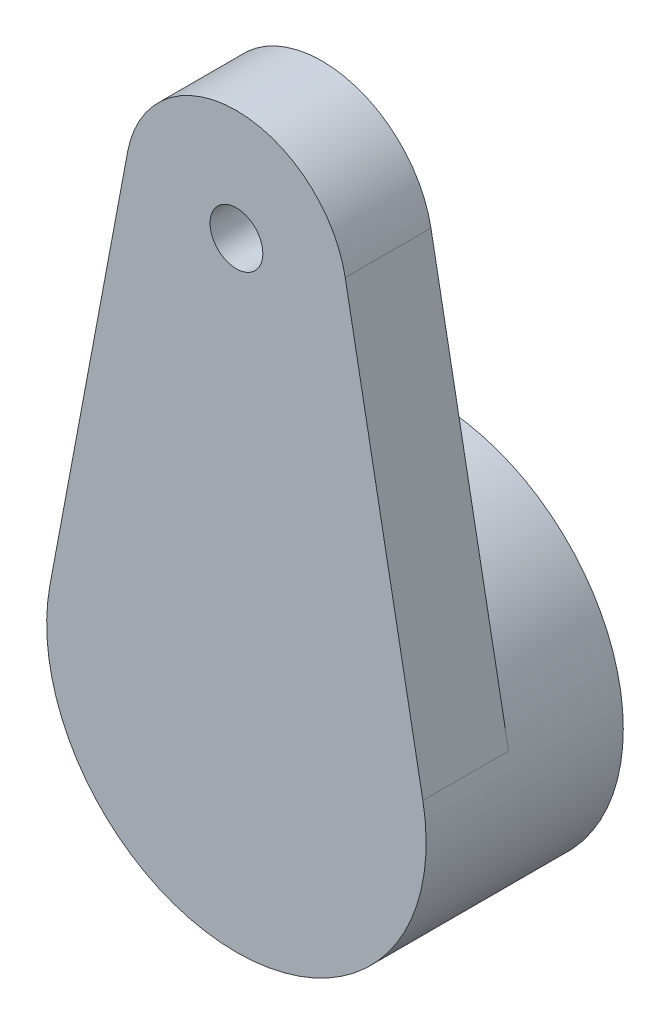
ISO-10303-21;
HEADER;
FILE_DESCRIPTION(('STEP AP214'),'2;1');
FILE_NAME('part.step','',(''),(''),'','','');
FILE_SCHEMA(('AUTOMOTIVE_DESIGN { 1 0 10303 214 1 1 1 1 }'));
ENDSEC;
DATA;
#1=APPLICATION_CONTEXT('core data for automotive mechanical design processes');
#2=APPLICATION_PROTOCOL_DEFINITION('international standard','automotive_design',2000,#1);
#3=PRODUCT_CONTEXT('',#1,'mechanical');
#4=PRODUCT('Part','Part','',(#3));
#5=PRODUCT_RELATED_PRODUCT_CATEGORY('part','',(#4));
#6=PRODUCT_DEFINITION_FORMATION('','',#4);
#7=PRODUCT_DEFINITION_CONTEXT('part definition',#1,'design');
#8=PRODUCT_DEFINITION('design','',#6,#7);
#9=PRODUCT_DEFINITION_SHAPE('','',#8);
#10=(LENGTH_UNIT() NAMED_UNIT(*) SI_UNIT(.MILLI.,.METRE.));
#11=(NAMED_UNIT(*) PLANE_ANGLE_UNIT() SI_UNIT($,.RADIAN.));
#12=(NAMED_UNIT(*) SI_UNIT($,.STERADIAN.) SOLID_ANGLE_UNIT());
#13=UNCERTAINTY_MEASURE_WITH_UNIT(LENGTH_MEASURE(1.E-05),#10,'distance_accuracy_value','');
#14=(GEOMETRIC_REPRESENTATION_CONTEXT(3) GLOBAL_UNCERTAINTY_ASSIGNED_CONTEXT((#13)) GLOBAL_UNIT_ASSIGNED_CONTEXT((#10,
#11,#12)) REPRESENTATION_CONTEXT('',''));
#15=CARTESIAN_POINT('',(0.,0.,0.));
#16=DIRECTION('',(0.,0.,1.));
#17=DIRECTION('',(1.,0.,0.));
#18=AXIS2_PLACEMENT_3D('',#15,#16,#17);
#19=CARTESIAN_POINT('',(0.,0.,3.5052));
#20=DIRECTION('',(0.,0.,-1.));
#21=DIRECTION('',(-1.,0.,0.));
#22=AXIS2_PLACEMENT_3D('',#19,#20,#21);
#23=CYLINDRICAL_SURFACE('',#22,2.33426);
#24=CARTESIAN_POINT('',(0.,0.,0.));
#25=DIRECTION('',(0.,0.,1.));
#26=DIRECTION('',(1.,0.,0.));
#27=AXIS2_PLACEMENT_3D('',#24,#25,#26);
#28=CIRCLE('',#27,2.33426);
#29=CARTESIAN_POINT('',(2.33426,0.,0.));
#30=VERTEX_POINT('',#29);
#31=EDGE_CURVE('E121',#30,#30,#28,.T.);
#32=ORIENTED_EDGE('',*,*,#31,.F.);
#33=EDGE_LOOP('',(#32));
#34=FACE_BOUND('',#33,.T.);
#35=CARTESIAN_POINT('',(0.,0.,2.6924));
#36=DIRECTION('',(0.,0.,1.));
#37=DIRECTION('',(1.,0.,0.));
#38=AXIS2_PLACEMENT_3D('',#35,#36,#37);
#39=CIRCLE('',#38,2.33426);
#40=CARTESIAN_POINT('',(2.33426,0.,2.6924));
#41=VERTEX_POINT('',#40);
#42=EDGE_CURVE('E114',#41,#41,#39,.F.);
#43=ORIENTED_EDGE('',*,*,#42,.F.);
#44=EDGE_LOOP('',(#43));
#45=FACE_BOUND('',#44,.T.);
#46=ADVANCED_FACE('F37',(#34,#45),#23,.F.);
#47=CARTESIAN_POINT('',(0.,0.,3.5052));
#48=DIRECTION('',(0.,0.,1.));
#49=DIRECTION('',(1.,0.,0.));
#50=AXIS2_PLACEMENT_3D('',#47,#48,#49);
#51=PLANE('',#50);
#52=CARTESIAN_POINT('',(0.,0.,3.5052));
#53=DIRECTION('',(0.,0.,1.));
#54=DIRECTION('',(1.,0.,0.));
#55=AXIS2_PLACEMENT_3D('',#52,#53,#54);
#56=CIRCLE('',#55,3.37312);
#57=CARTESIAN_POINT('',(-3.31531749450492,0.621778453333334,3.5052));
#58=VERTEX_POINT('',#57);
#59=CARTESIAN_POINT('',(3.31531749450492,0.621778453333334,3.5052));
#60=VERTEX_POINT('',#59);
#61=EDGE_CURVE('E12',#58,#60,#56,.T.);
#62=ORIENTED_EDGE('',*,*,#61,.T.);
#63=DIRECTION('',(0.184333333333334,-0.982863786199401,0.));
#64=VECTOR('',#63,1.);
#65=CARTESIAN_POINT('',(3.31531749450492,0.621778453333334,3.5052));
#66=LINE('',#65,#64);
#67=CARTESIAN_POINT('',(1.93476736313352,7.98286016666667,3.5052));
#68=VERTEX_POINT('',#67);
#69=EDGE_CURVE('E95',#68,#60,#66,.T.);
#70=ORIENTED_EDGE('',*,*,#69,.F.);
#71=CARTESIAN_POINT('',(0.,7.62,3.5052));
#72=DIRECTION('',(0.,0.,1.));
#73=DIRECTION('',(1.,0.,0.));
#74=AXIS2_PLACEMENT_3D('',#71,#72,#73);
#75=CIRCLE('',#74,1.9685);
#76=CARTESIAN_POINT('',(-1.93476736313352,7.98286016666667,3.5052));
#77=VERTEX_POINT('',#76);
#78=EDGE_CURVE('E116',#68,#77,#75,.T.);
#79=ORIENTED_EDGE('',*,*,#78,.T.);
#80=DIRECTION('',(-0.184333333333333,-0.982863786199401,0.));
#81=VECTOR('',#80,1.);
#82=CARTESIAN_POINT('',(-3.31531749450492,0.621778453333334,3.5052));
#83=LINE('',#82,#81);
#84=EDGE_CURVE('E51',#77,#58,#83,.T.);
#85=ORIENTED_EDGE('',*,*,#84,.T.);
#86=EDGE_LOOP('',(#62,#70,#79,#85));
#87=FACE_BOUND('',#86,.T.);
#88=CARTESIAN_POINT('',(0.,7.62,3.5052));
#89=DIRECTION('',(0.,0.,1.));
#90=DIRECTION('',(1.,0.,0.));
#91=AXIS2_PLACEMENT_3D('',#88,#89,#90);
#92=CIRCLE('',#91,0.4699);
#93=CARTESIAN_POINT('',(0.4699,7.62,3.5052));
#94=VERTEX_POINT('',#93);
#95=EDGE_CURVE('E105',#94,#94,#92,.T.);
#96=ORIENTED_EDGE('',*,*,#95,.F.);
#97=EDGE_LOOP('',(#96));
#98=FACE_BOUND('',#97,.T.);
#99=ADVANCED_FACE('F132',(#87,#98),#51,.T.);
#100=CARTESIAN_POINT('',(0.,0.,0.));
#101=DIRECTION('',(0.,0.,1.));
#102=DIRECTION('',(1.,0.,0.));
#103=AXIS2_PLACEMENT_3D('',#100,#101,#102);
#104=PLANE('',#103);
#105=CARTESIAN_POINT('',(0.,0.,0.));
#106=DIRECTION('',(0.,0.,1.));
#107=DIRECTION('',(1.,0.,0.));
#108=AXIS2_PLACEMENT_3D('',#105,#106,#107);
#109=CIRCLE('',#108,3.37312);
#110=CARTESIAN_POINT('',(3.37312,0.,0.));
#111=VERTEX_POINT('',#110);
#112=EDGE_CURVE('E41',#111,#111,#109,.T.);
#113=ORIENTED_EDGE('',*,*,#112,.F.);
#114=EDGE_LOOP('',(#113));
#115=FACE_BOUND('',#114,.T.);
#116=ORIENTED_EDGE('',*,*,#31,.T.);
#117=EDGE_LOOP('',(#116));
#118=FACE_BOUND('',#117,.T.);
#119=ADVANCED_FACE('F130',(#115,#118),#104,.F.);
#120=CARTESIAN_POINT('',(0.,0.,3.5052));
#121=DIRECTION('',(0.,0.,-1.));
#122=DIRECTION('',(-1.,0.,0.));
#123=AXIS2_PLACEMENT_3D('',#120,#121,#122);
#124=CYLINDRICAL_SURFACE('',#123,3.37312);
#125=ORIENTED_EDGE('',*,*,#61,.F.);
#126=DIRECTION('',(0.,0.,1.));
#127=VECTOR('',#126,1.);
#128=CARTESIAN_POINT('',(-3.31531749450492,0.621778453333334,1.9812));
#129=LINE('',#128,#127);
#130=CARTESIAN_POINT('',(-3.31531749450492,0.621778453333334,1.9812));
#131=VERTEX_POINT('',#130);
#132=EDGE_CURVE('E99',#131,#58,#129,.T.);
#133=ORIENTED_EDGE('',*,*,#132,.F.);
#134=CARTESIAN_POINT('',(0.,0.,1.9812));
#135=DIRECTION('',(0.,0.,1.));
#136=DIRECTION('',(1.,0.,0.));
#137=AXIS2_PLACEMENT_3D('',#134,#135,#136);
#138=CIRCLE('',#137,3.37312);
#139=CARTESIAN_POINT('',(3.31531749450492,0.621778453333334,1.9812));
#140=VERTEX_POINT('',#139);
#141=EDGE_CURVE('E81',#140,#131,#138,.T.);
#142=ORIENTED_EDGE('',*,*,#141,.F.);
#143=DIRECTION('',(0.,0.,1.));
#144=VECTOR('',#143,1.);
#145=CARTESIAN_POINT('',(3.31531749450492,0.621778453333334,1.9812));
#146=LINE('',#145,#144);
#147=EDGE_CURVE('E92',#140,#60,#146,.T.);
#148=ORIENTED_EDGE('',*,*,#147,.T.);
#149=EDGE_LOOP('',(#125,#133,#142,#148));
#150=FACE_BOUND('',#149,.T.);
#151=ORIENTED_EDGE('',*,*,#112,.T.);
#152=EDGE_LOOP('',(#151));
#153=FACE_BOUND('',#152,.T.);
#154=ADVANCED_FACE('F39',(#150,#153),#124,.T.);
#155=CARTESIAN_POINT('',(-3.31531749450492,0.621778453333334,1.9812));
#156=DIRECTION('',(-0.982863786199401,0.184333333333333,0.));
#157=DIRECTION('',(-0.184333333333333,-0.982863786199401,0.));
#158=AXIS2_PLACEMENT_3D('',#155,#156,#157);
#159=PLANE('',#158);
#160=ORIENTED_EDGE('',*,*,#84,.F.);
#161=DIRECTION('',(0.,0.,1.));
#162=VECTOR('',#161,1.);
#163=CARTESIAN_POINT('',(-1.93476736313352,7.98286016666667,1.9812));
#164=LINE('',#163,#162);
#165=CARTESIAN_POINT('',(-1.93476736313352,7.98286016666667,1.9812));
#166=VERTEX_POINT('',#165);
#167=EDGE_CURVE('E59',#166,#77,#164,.T.);
#168=ORIENTED_EDGE('',*,*,#167,.F.);
#169=DIRECTION('',(-0.184333333333333,-0.982863786199401,0.));
#170=VECTOR('',#169,1.);
#171=CARTESIAN_POINT('',(-3.31531749450492,0.621778453333334,1.9812));
#172=LINE('',#171,#170);
#173=EDGE_CURVE('E103',#166,#131,#172,.T.);
#174=ORIENTED_EDGE('',*,*,#173,.T.);
#175=ORIENTED_EDGE('',*,*,#132,.T.);
#176=EDGE_LOOP('',(#160,#168,#174,#175));
#177=FACE_BOUND('',#176,.T.);
#178=ADVANCED_FACE('F137',(#177),#159,.T.);
#179=CARTESIAN_POINT('',(0.,7.62,1.9812));
#180=DIRECTION('',(0.,0.,1.));
#181=DIRECTION('',(1.,0.,0.));
#182=AXIS2_PLACEMENT_3D('',#179,#180,#181);
#183=CYLINDRICAL_SURFACE('',#182,1.9685);
#184=ORIENTED_EDGE('',*,*,#78,.F.);
#185=DIRECTION('',(0.,0.,1.));
#186=VECTOR('',#185,1.);
#187=CARTESIAN_POINT('',(1.93476736313352,7.98286016666667,1.9812));
#188=LINE('',#187,#186);
#189=CARTESIAN_POINT('',(1.93476736313352,7.98286016666667,1.9812));
#190=VERTEX_POINT('',#189);
#191=EDGE_CURVE('E98',#190,#68,#188,.T.);
#192=ORIENTED_EDGE('',*,*,#191,.F.);
#193=CARTESIAN_POINT('',(0.,7.62,1.9812));
#194=DIRECTION('',(0.,0.,1.));
#195=DIRECTION('',(1.,0.,0.));
#196=AXIS2_PLACEMENT_3D('',#193,#194,#195);
#197=CIRCLE('',#196,1.9685);
#198=EDGE_CURVE('E88',#190,#166,#197,.T.);
#199=ORIENTED_EDGE('',*,*,#198,.T.);
#200=ORIENTED_EDGE('',*,*,#167,.T.);
#201=EDGE_LOOP('',(#184,#192,#199,#200));
#202=FACE_BOUND('',#201,.T.);
#203=ADVANCED_FACE('F148',(#202),#183,.T.);
#204=CARTESIAN_POINT('',(3.31531749450492,0.621778453333334,1.9812));
#205=DIRECTION('',(-0.982863786199401,-0.184333333333334,0.));
#206=DIRECTION('',(0.184333333333334,-0.982863786199401,0.));
#207=AXIS2_PLACEMENT_3D('',#204,#205,#206);
#208=PLANE('',#207);
#209=ORIENTED_EDGE('',*,*,#69,.T.);
#210=ORIENTED_EDGE('',*,*,#147,.F.);
#211=DIRECTION('',(0.184333333333334,-0.982863786199401,0.));
#212=VECTOR('',#211,1.);
#213=CARTESIAN_POINT('',(3.31531749450492,0.621778453333334,1.9812));
#214=LINE('',#213,#212);
#215=EDGE_CURVE('E84',#190,#140,#214,.T.);
#216=ORIENTED_EDGE('',*,*,#215,.F.);
#217=ORIENTED_EDGE('',*,*,#191,.T.);
#218=EDGE_LOOP('',(#209,#210,#216,#217));
#219=FACE_BOUND('',#218,.T.);
#220=ADVANCED_FACE('F93',(#219),#208,.F.);
#221=CARTESIAN_POINT('',(0.,7.62,1.9812));
#222=DIRECTION('',(0.,0.,1.));
#223=DIRECTION('',(1.,0.,0.));
#224=AXIS2_PLACEMENT_3D('',#221,#222,#223);
#225=CYLINDRICAL_SURFACE('',#224,0.4699);
#226=CARTESIAN_POINT('',(0.,7.62,1.9812));
#227=DIRECTION('',(0.,0.,1.));
#228=DIRECTION('',(1.,0.,0.));
#229=AXIS2_PLACEMENT_3D('',#226,#227,#228);
#230=CIRCLE('',#229,0.4699);
#231=CARTESIAN_POINT('',(0.4699,7.62,1.9812));
#232=VERTEX_POINT('',#231);
#233=EDGE_CURVE('E110',#232,#232,#230,.T.);
#234=ORIENTED_EDGE('',*,*,#233,.F.);
#235=EDGE_LOOP('',(#234));
#236=FACE_BOUND('',#235,.T.);
#237=ORIENTED_EDGE('',*,*,#95,.T.);
#238=EDGE_LOOP('',(#237));
#239=FACE_BOUND('',#238,.T.);
#240=ADVANCED_FACE('F151',(#236,#239),#225,.F.);
#241=CARTESIAN_POINT('',(0.,0.,1.9812));
#242=DIRECTION('',(0.,0.,1.));
#243=DIRECTION('',(1.,0.,0.));
#244=AXIS2_PLACEMENT_3D('',#241,#242,#243);
#245=PLANE('',#244);
#246=ORIENTED_EDGE('',*,*,#173,.F.);
#247=ORIENTED_EDGE('',*,*,#198,.F.);
#248=ORIENTED_EDGE('',*,*,#215,.T.);
#249=ORIENTED_EDGE('',*,*,#141,.T.);
#250=EDGE_LOOP('',(#246,#247,#248,#249));
#251=FACE_BOUND('',#250,.T.);
#252=ORIENTED_EDGE('',*,*,#233,.T.);
#253=EDGE_LOOP('',(#252));
#254=FACE_BOUND('',#253,.T.);
#255=ADVANCED_FACE('F86',(#251,#254),#245,.F.);
#256=CARTESIAN_POINT('',(0.,0.,2.6924));
#257=DIRECTION('',(0.,0.,1.));
#258=DIRECTION('',(1.,0.,0.));
#259=AXIS2_PLACEMENT_3D('',#256,#257,#258);
#260=PLANE('',#259);
#261=ORIENTED_EDGE('',*,*,#42,.T.);
#262=EDGE_LOOP('',(#261));
#263=FACE_BOUND('',#262,.T.);
#264=ADVANCED_FACE('F159',(#263),#260,.F.);
#265=CLOSED_SHELL('',(#46,#99,#119,#154,#178,#203,#220,#240,#255,#264));
#266=MANIFOLD_SOLID_BREP('B2',#265);
#267=ADVANCED_BREP_SHAPE_REPRESENTATION('',(#18,#266),#14);
#268=SHAPE_DEFINITION_REPRESENTATION(#9,#267);
ENDSEC;
END-ISO-10303-21;
